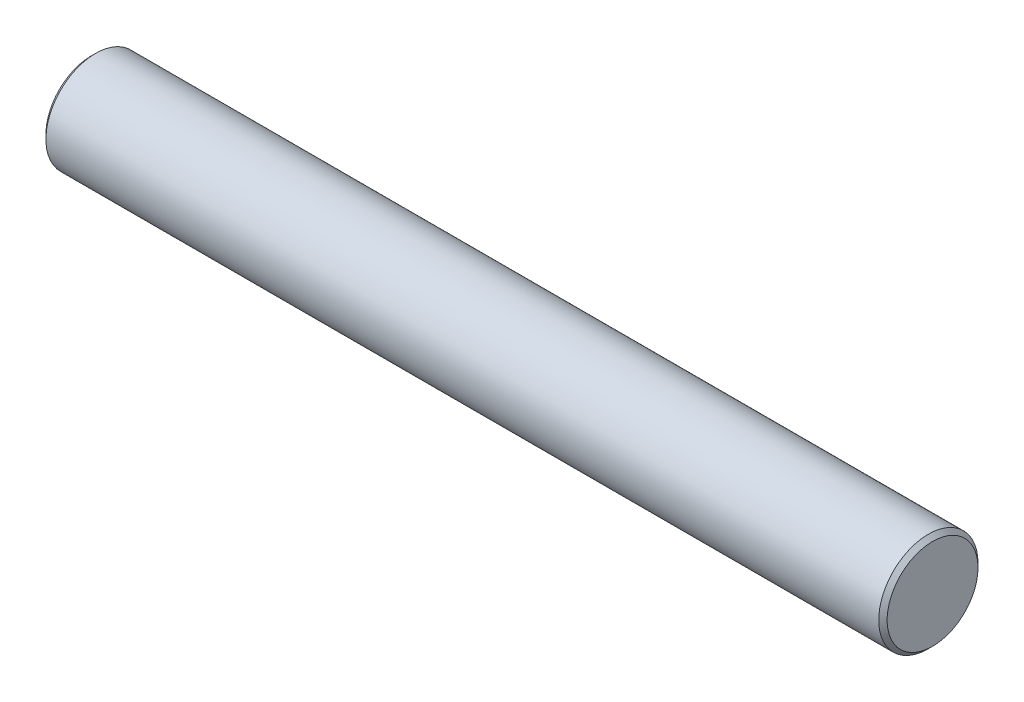
ISO-10303-21;
HEADER;
FILE_DESCRIPTION(('STEP AP214'),'2;1');
FILE_NAME('part.step','',(''),(''),'','','');
FILE_SCHEMA(('AUTOMOTIVE_DESIGN { 1 0 10303 214 1 1 1 1 }'));
ENDSEC;
DATA;
#1=APPLICATION_CONTEXT('core data for automotive mechanical design processes');
#2=APPLICATION_PROTOCOL_DEFINITION('international standard','automotive_design',2000,#1);
#3=PRODUCT_CONTEXT('',#1,'mechanical');
#4=PRODUCT('Part','Part','',(#3));
#5=PRODUCT_RELATED_PRODUCT_CATEGORY('part','',(#4));
#6=PRODUCT_DEFINITION_FORMATION('','',#4);
#7=PRODUCT_DEFINITION_CONTEXT('part definition',#1,'design');
#8=PRODUCT_DEFINITION('design','',#6,#7);
#9=PRODUCT_DEFINITION_SHAPE('','',#8);
#10=(LENGTH_UNIT() NAMED_UNIT(*) SI_UNIT(.MILLI.,.METRE.));
#11=(NAMED_UNIT(*) PLANE_ANGLE_UNIT() SI_UNIT($,.RADIAN.));
#12=(NAMED_UNIT(*) SI_UNIT($,.STERADIAN.) SOLID_ANGLE_UNIT());
#13=UNCERTAINTY_MEASURE_WITH_UNIT(LENGTH_MEASURE(1.E-05),#10,'distance_accuracy_value','');
#14=(GEOMETRIC_REPRESENTATION_CONTEXT(3) GLOBAL_UNCERTAINTY_ASSIGNED_CONTEXT((#13)) GLOBAL_UNIT_ASSIGNED_CONTEXT((#10,
#11,#12)) REPRESENTATION_CONTEXT('',''));
#15=CARTESIAN_POINT('',(0.,0.,0.));
#16=DIRECTION('',(0.,0.,1.));
#17=DIRECTION('',(1.,0.,0.));
#18=AXIS2_PLACEMENT_3D('',#15,#16,#17);
#19=CARTESIAN_POINT('',(12.7,1.3716,0.));
#20=DIRECTION('',(1.,0.,0.));
#21=DIRECTION('',(0.,0.,-1.));
#22=AXIS2_PLACEMENT_3D('',#19,#20,#21);
#23=PLANE('',#22);
#24=CARTESIAN_POINT('',(12.7,0.,0.));
#25=DIRECTION('',(1.,0.,0.));
#26=DIRECTION('',(0.,0.,-1.));
#27=AXIS2_PLACEMENT_3D('',#24,#25,#26);
#28=CIRCLE('',#27,1.3716);
#29=CARTESIAN_POINT('',(12.7,0.,-1.3716));
#30=VERTEX_POINT('',#29);
#31=EDGE_CURVE('E10',#30,#30,#28,.T.);
#32=ORIENTED_EDGE('',*,*,#31,.T.);
#33=EDGE_LOOP('',(#32));
#34=FACE_BOUND('',#33,.T.);
#35=ADVANCED_FACE('F31',(#34),#23,.T.);
#36=CARTESIAN_POINT('',(12.7,0.,0.));
#37=DIRECTION('',(-1.,0.,0.));
#38=DIRECTION('',(0.,0.,1.));
#39=AXIS2_PLACEMENT_3D('',#36,#37,#38);
#40=CONICAL_SURFACE('',#39,1.3716,0.785398163397447);
#41=CARTESIAN_POINT('',(12.573,0.,0.));
#42=DIRECTION('',(1.,0.,0.));
#43=DIRECTION('',(0.,0.,-1.));
#44=AXIS2_PLACEMENT_3D('',#41,#42,#43);
#45=CIRCLE('',#44,1.4986);
#46=CARTESIAN_POINT('',(12.573,0.,-1.4986));
#47=VERTEX_POINT('',#46);
#48=EDGE_CURVE('E37',#47,#47,#45,.T.);
#49=ORIENTED_EDGE('',*,*,#48,.T.);
#50=EDGE_LOOP('',(#49));
#51=FACE_BOUND('',#50,.T.);
#52=ORIENTED_EDGE('',*,*,#31,.F.);
#53=EDGE_LOOP('',(#52));
#54=FACE_BOUND('',#53,.T.);
#55=ADVANCED_FACE('F63',(#51,#54),#40,.T.);
#56=CARTESIAN_POINT('',(12.7,0.,0.));
#57=DIRECTION('',(1.,0.,0.));
#58=DIRECTION('',(0.,0.,-1.));
#59=AXIS2_PLACEMENT_3D('',#56,#57,#58);
#60=CYLINDRICAL_SURFACE('',#59,1.4986);
#61=CARTESIAN_POINT('',(-12.573,0.,0.));
#62=DIRECTION('',(1.,0.,0.));
#63=DIRECTION('',(0.,0.,-1.));
#64=AXIS2_PLACEMENT_3D('',#61,#62,#63);
#65=CIRCLE('',#64,1.4986);
#66=CARTESIAN_POINT('',(-12.573,0.,-1.4986));
#67=VERTEX_POINT('',#66);
#68=EDGE_CURVE('E41',#67,#67,#65,.T.);
#69=ORIENTED_EDGE('',*,*,#68,.T.);
#70=EDGE_LOOP('',(#69));
#71=FACE_BOUND('',#70,.T.);
#72=ORIENTED_EDGE('',*,*,#48,.F.);
#73=EDGE_LOOP('',(#72));
#74=FACE_BOUND('',#73,.T.);
#75=ADVANCED_FACE('F60',(#71,#74),#60,.T.);
#76=CARTESIAN_POINT('',(-12.573,0.,0.));
#77=DIRECTION('',(1.,0.,0.));
#78=DIRECTION('',(0.,0.,-1.));
#79=AXIS2_PLACEMENT_3D('',#76,#77,#78);
#80=CONICAL_SURFACE('',#79,1.4986,0.78539816339744);
#81=CARTESIAN_POINT('',(-12.7,0.,0.));
#82=DIRECTION('',(1.,0.,0.));
#83=DIRECTION('',(0.,0.,-1.));
#84=AXIS2_PLACEMENT_3D('',#81,#82,#83);
#85=CIRCLE('',#84,1.3716);
#86=CARTESIAN_POINT('',(-12.7,0.,-1.3716));
#87=VERTEX_POINT('',#86);
#88=EDGE_CURVE('E45',#87,#87,#85,.T.);
#89=ORIENTED_EDGE('',*,*,#88,.T.);
#90=EDGE_LOOP('',(#89));
#91=FACE_BOUND('',#90,.T.);
#92=ORIENTED_EDGE('',*,*,#68,.F.);
#93=EDGE_LOOP('',(#92));
#94=FACE_BOUND('',#93,.T.);
#95=ADVANCED_FACE('F51',(#91,#94),#80,.T.);
#96=CARTESIAN_POINT('',(-12.7,1.3716,0.));
#97=DIRECTION('',(-1.,0.,0.));
#98=DIRECTION('',(0.,0.,1.));
#99=AXIS2_PLACEMENT_3D('',#96,#97,#98);
#100=PLANE('',#99);
#101=ORIENTED_EDGE('',*,*,#88,.F.);
#102=EDGE_LOOP('',(#101));
#103=FACE_BOUND('',#102,.T.);
#104=ADVANCED_FACE('F54',(#103),#100,.T.);
#105=CLOSED_SHELL('',(#35,#55,#75,#95,#104));
#106=MANIFOLD_SOLID_BREP('B2',#105);
#107=ADVANCED_BREP_SHAPE_REPRESENTATION('',(#18,#106),#14);
#108=SHAPE_DEFINITION_REPRESENTATION(#9,#107);
ENDSEC;
END-ISO-10303-21;
